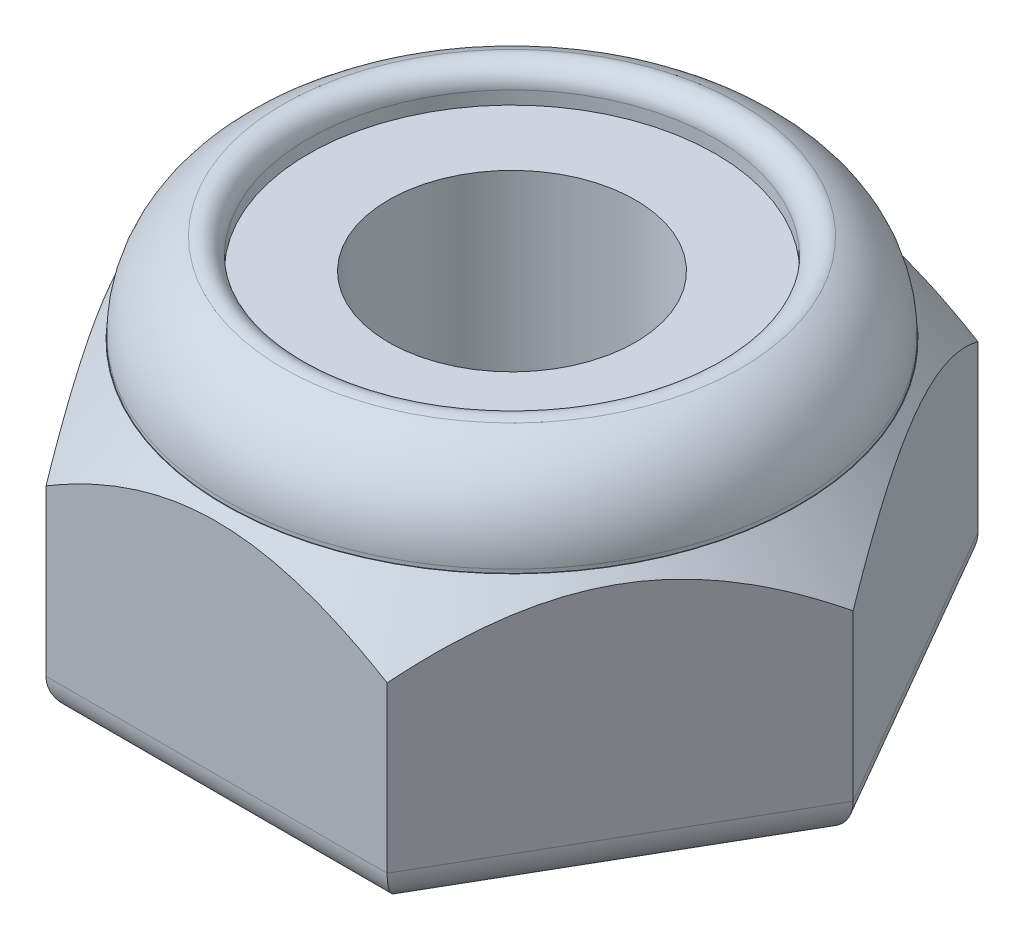
ISO-10303-21;
HEADER;
FILE_DESCRIPTION(('STEP AP214'),'2;1');
FILE_NAME('part.step','',(''),(''),'','','');
FILE_SCHEMA(('AUTOMOTIVE_DESIGN { 1 0 10303 214 1 1 1 1 }'));
ENDSEC;
DATA;
#1=APPLICATION_CONTEXT('core data for automotive mechanical design processes');
#2=APPLICATION_PROTOCOL_DEFINITION('international standard','automotive_design',2000,#1);
#3=PRODUCT_CONTEXT('',#1,'mechanical');
#4=PRODUCT('Part','Part','',(#3));
#5=PRODUCT_RELATED_PRODUCT_CATEGORY('part','',(#4));
#6=PRODUCT_DEFINITION_FORMATION('','',#4);
#7=PRODUCT_DEFINITION_CONTEXT('part definition',#1,'design');
#8=PRODUCT_DEFINITION('design','',#6,#7);
#9=PRODUCT_DEFINITION_SHAPE('','',#8);
#10=(LENGTH_UNIT() NAMED_UNIT(*) SI_UNIT(.MILLI.,.METRE.));
#11=(NAMED_UNIT(*) PLANE_ANGLE_UNIT() SI_UNIT($,.RADIAN.));
#12=(NAMED_UNIT(*) SI_UNIT($,.STERADIAN.) SOLID_ANGLE_UNIT());
#13=UNCERTAINTY_MEASURE_WITH_UNIT(LENGTH_MEASURE(1.E-05),#10,'distance_accuracy_value','');
#14=(GEOMETRIC_REPRESENTATION_CONTEXT(3) GLOBAL_UNCERTAINTY_ASSIGNED_CONTEXT((#13)) GLOBAL_UNIT_ASSIGNED_CONTEXT((#10,
#11,#12)) REPRESENTATION_CONTEXT('',''));
#15=CARTESIAN_POINT('',(0.,0.,0.));
#16=DIRECTION('',(0.,0.,1.));
#17=DIRECTION('',(1.,0.,0.));
#18=AXIS2_PLACEMENT_3D('',#15,#16,#17);
#19=CARTESIAN_POINT('',(0.,4.9784,0.));
#20=DIRECTION('',(0.,-1.,0.));
#21=DIRECTION('',(0.,0.,-1.));
#22=AXIS2_PLACEMENT_3D('',#19,#20,#21);
#23=CYLINDRICAL_SURFACE('',#22,3.937);
#24=CARTESIAN_POINT('',(0.,3.7084,0.));
#25=DIRECTION('',(0.,1.,0.));
#26=DIRECTION('',(0.,0.,1.));
#27=AXIS2_PLACEMENT_3D('',#24,#25,#26);
#28=CIRCLE('',#27,3.937);
#29=CARTESIAN_POINT('',(0.,3.7084,3.937));
#30=VERTEX_POINT('',#29);
#31=EDGE_CURVE('E249',#30,#30,#28,.T.);
#32=ORIENTED_EDGE('',*,*,#31,.F.);
#33=EDGE_LOOP('',(#32));
#34=FACE_BOUND('',#33,.T.);
#35=CARTESIAN_POINT('',(0.,3.6576,0.));
#36=DIRECTION('',(0.,-1.,0.));
#37=DIRECTION('',(0.,0.,-1.));
#38=AXIS2_PLACEMENT_3D('',#35,#36,#37);
#39=CIRCLE('',#38,3.937);
#40=CARTESIAN_POINT('',(0.,3.6576,-3.937));
#41=VERTEX_POINT('',#40);
#42=EDGE_CURVE('E19',#41,#41,#39,.F.);
#43=ORIENTED_EDGE('',*,*,#42,.T.);
#44=EDGE_LOOP('',(#43));
#45=FACE_BOUND('',#44,.T.);
#46=ADVANCED_FACE('F16',(#34,#45),#23,.T.);
#47=CARTESIAN_POINT('',(0.,3.7084,0.));
#48=DIRECTION('',(0.,1.,0.));
#49=DIRECTION('',(0.,0.,1.));
#50=AXIS2_PLACEMENT_3D('',#47,#48,#49);
#51=TOROIDAL_SURFACE('',#50,2.667,1.27);
#52=ORIENTED_EDGE('',*,*,#31,.T.);
#53=EDGE_LOOP('',(#52));
#54=FACE_BOUND('',#53,.T.);
#55=CARTESIAN_POINT('',(0.,4.88572150982644,0.));
#56=DIRECTION('',(0.,-1.,0.));
#57=DIRECTION('',(0.,0.,-1.));
#58=AXIS2_PLACEMENT_3D('',#55,#56,#57);
#59=CIRCLE('',#58,3.14325);
#60=CARTESIAN_POINT('',(0.,4.88572150982644,-3.14325));
#61=VERTEX_POINT('',#60);
#62=EDGE_CURVE('E243',#61,#61,#59,.F.);
#63=ORIENTED_EDGE('',*,*,#62,.F.);
#64=EDGE_LOOP('',(#63));
#65=FACE_BOUND('',#64,.T.);
#66=ADVANCED_FACE('F134',(#54,#65),#51,.T.);
#67=CARTESIAN_POINT('',(2.34315,3.6576,4.05845484975502));
#68=DIRECTION('',(0.,-1.,0.));
#69=DIRECTION('',(0.,0.,-1.));
#70=AXIS2_PLACEMENT_3D('',#67,#68,#69);
#71=PLANE('',#70);
#72=ORIENTED_EDGE('',*,*,#42,.F.);
#73=EDGE_LOOP('',(#72));
#74=FACE_BOUND('',#73,.T.);
#75=CARTESIAN_POINT('',(0.,3.65760000011051,0.));
#76=DIRECTION('',(0.,-1.,0.));
#77=DIRECTION('',(0.,0.,-1.));
#78=AXIS2_PLACEMENT_3D('',#75,#76,#77);
#79=CIRCLE('',#78,3.94407100938664);
#80=CARTESIAN_POINT('',(0.,3.65760000011051,-3.94407100938664));
#81=VERTEX_POINT('',#80);
#82=EDGE_CURVE('E119',#81,#81,#79,.T.);
#83=ORIENTED_EDGE('',*,*,#82,.F.);
#84=EDGE_LOOP('',(#83));
#85=FACE_BOUND('',#84,.T.);
#86=ADVANCED_FACE('F129',(#74,#85),#71,.F.);
#87=CARTESIAN_POINT('',(0.,4.65025720786115,0.));
#88=DIRECTION('',(0.,-1.,0.));
#89=DIRECTION('',(0.,0.,-1.));
#90=AXIS2_PLACEMENT_3D('',#87,#88,#89);
#91=TOROIDAL_SURFACE('',#90,3.048,0.254);
#92=CARTESIAN_POINT('',(0.,4.65025720786115,0.));
#93=DIRECTION('',(0.,1.,0.));
#94=DIRECTION('',(0.,0.,1.));
#95=AXIS2_PLACEMENT_3D('',#92,#93,#94);
#96=CIRCLE('',#95,2.794);
#97=CARTESIAN_POINT('',(0.,4.65025720786115,2.794));
#98=VERTEX_POINT('',#97);
#99=EDGE_CURVE('E104',#98,#98,#96,.F.);
#100=ORIENTED_EDGE('',*,*,#99,.T.);
#101=EDGE_LOOP('',(#100));
#102=FACE_BOUND('',#101,.T.);
#103=ORIENTED_EDGE('',*,*,#62,.T.);
#104=EDGE_LOOP('',(#103));
#105=FACE_BOUND('',#104,.T.);
#106=ADVANCED_FACE('F125',(#102,#105),#91,.T.);
#107=CARTESIAN_POINT('',(0.,2.76773860969115,0.));
#108=DIRECTION('',(0.,-1.,0.));
#109=DIRECTION('',(0.,0.,-1.));
#110=AXIS2_PLACEMENT_3D('',#107,#108,#109);
#111=CONICAL_SURFACE('',#110,4.69075337389313,0.698131700802158);
#112=CARTESIAN_POINT('',(-4.68630000001476,2.77304593398821,-5.3333815551093E-11));
#113=CARTESIAN_POINT('',(-4.65177717141793,2.81418235889091,0.0597952931149053));
#114=CARTESIAN_POINT('',(-4.61695780288956,2.85432113110728,0.120104208500933));
#115=CARTESIAN_POINT('',(-4.54666264441453,2.93230661020916,0.241858994511412));
#116=CARTESIAN_POINT('',(-4.51118655194523,2.97015222462005,0.303305389120424));
#117=CARTESIAN_POINT('',(-4.40329561885259,3.08018701500149,0.490177966909938));
#118=CARTESIAN_POINT('',(-4.32983334004397,3.14837015576205,0.617418366247689));
#119=CARTESIAN_POINT('',(-4.1797796499728,3.27092778609509,0.877318981315214));
#120=CARTESIAN_POINT('',(-4.10317943932402,3.32525984886677,1.00999443802899));
#121=CARTESIAN_POINT('',(-3.94747591651278,3.41577217646147,1.27968085045525));
#122=CARTESIAN_POINT('',(-3.86837998243724,3.45200143013375,1.4166790269463));
#123=CARTESIAN_POINT('',(-3.73746585196202,3.49372811243502,1.64342895235813));
#124=CARTESIAN_POINT('',(-3.68614686019516,3.50560413715319,1.73231605349153));
#125=CARTESIAN_POINT('',(-3.58316406708587,3.52008140702852,1.91068748346216));
#126=CARTESIAN_POINT('',(-3.53150020834088,3.5226810675312,2.00017191172355));
#127=CARTESIAN_POINT('',(-3.42855034551142,3.51847006524789,2.17848630477643));
#128=CARTESIAN_POINT('',(-3.3772638088531,3.51171021118305,2.26731719201287));
#129=CARTESIAN_POINT('',(-3.27519197708947,3.48921023555424,2.4441107906491));
#130=CARTESIAN_POINT('',(-3.22440670715057,3.4734696654174,2.53207345845939));
#131=CARTESIAN_POINT('',(-3.10963060134479,3.42817062222156,2.73087150520989));
#132=CARTESIAN_POINT('',(-3.04589899577138,3.39598542076133,2.84125788411098));
#133=CARTESIAN_POINT('',(-2.92018166739655,3.32004827846255,3.05900668424801));
#134=CARTESIAN_POINT('',(-2.85819691962206,3.27629001415058,3.16636741668776));
#135=CARTESIAN_POINT('',(-2.735889068299,3.17910361386979,3.37821082934389));
#136=CARTESIAN_POINT('',(-2.67557364738244,3.12563730731956,3.48268020285126));
#137=CARTESIAN_POINT('',(-2.55683004320588,3.01104764609313,3.68835015835892));
#138=CARTESIAN_POINT('',(-2.49840123089761,2.94992687749399,3.78955182990274));
#139=CARTESIAN_POINT('',(-2.42439626092569,2.86741854625153,3.91773219790672));
#140=CARTESIAN_POINT('',(-2.40802320106583,2.84883596648691,3.94609116945937));
#141=CARTESIAN_POINT('',(-2.3754621576302,2.81125673907332,4.00248855103733));
#142=CARTESIAN_POINT('',(-2.35927376441604,2.79226151161516,4.03052767057717));
#143=CARTESIAN_POINT('',(-2.3431499999717,2.77304593399368,4.05845484980404));
#144=B_SPLINE_CURVE_WITH_KNOTS('',3,(#112,#113,#114,#115,#116,#117,#118,#119,#120,#121,#122,
#123,#124,#125,#126,#127,#128,#129,#130,#131,#132,#133,#134,#135,#136,#137,#138,#139,#140,#141,
#142,#143),.UNSPECIFIED.,.F.,.F.,(4,2,2,2,2,2,2,2,2,2,2,2,2,2,2,4),(0.,0.241096809088565,
0.48230758945251,0.967637153847365,1.45443592242802,1.93991010956963,2.24950193433618,
2.5591466432483,2.86711700071403,3.17510274216898,3.56882084711336,3.96275452403261,
4.35827201930639,4.75365624679115,4.86660838982693,4.97921936905084),.UNSPECIFIED.);
#145=CARTESIAN_POINT('',(-4.68630000002839,2.77304593399358,0.));
#146=VERTEX_POINT('',#145);
#147=CARTESIAN_POINT('',(-2.34315000001419,2.77304593399358,4.05845484977959));
#148=VERTEX_POINT('',#147);
#149=EDGE_CURVE('E91',#146,#148,#144,.T.);
#150=ORIENTED_EDGE('',*,*,#149,.T.);
#151=CARTESIAN_POINT('',(-2.34315000005357,2.77304593398822,4.05845484974113));
#152=CARTESIAN_POINT('',(-2.27415972170409,2.81414935271336,4.05845484974989));
#153=CARTESIAN_POINT('',(-2.20457738522044,2.85425669884705,4.05845484975361));
#154=CARTESIAN_POINT('',(-2.06410193528096,2.93218331968193,4.05845484975642));
#155=CARTESIAN_POINT('',(-1.99320821641151,2.9700015013142,4.05845484975551));
#156=CARTESIAN_POINT('',(-1.77754688772429,3.07999086386455,4.05845484975401));
#157=CARTESIAN_POINT('',(-1.63068545869954,3.1481589403704,4.05845484975469));
#158=CARTESIAN_POINT('',(-1.33052752457963,3.27077676919262,4.05845484975534));
#159=CARTESIAN_POINT('',(-1.17720631609342,3.32516696804196,4.0584548497553));
#160=CARTESIAN_POINT('',(-0.865613503807779,3.41574608766059,4.05845484975473));
#161=CARTESIAN_POINT('',(-0.707359229311903,3.45199244874899,4.0584548497542));
#162=CARTESIAN_POINT('',(-0.456822143345071,3.49192146546895,4.05845484975548));
#163=CARTESIAN_POINT('',(-0.365672921156202,3.50290887295604,4.05845484975637));
#164=CARTESIAN_POINT('',(-0.183016322004482,3.51758027913678,4.05845484975366));
#165=CARTESIAN_POINT('',(-0.0915105175250817,3.52128341037061,4.05845484975007));
#166=CARTESIAN_POINT('',(0.104649468641441,3.52128177491765,4.0584548497495));
#167=CARTESIAN_POINT('',(0.209305100872023,3.51643705333648,4.05845484975354));
#168=CARTESIAN_POINT('',(0.417787181909869,3.49730239560235,4.05845484975649));
#169=CARTESIAN_POINT('',(0.521613181352877,3.48300765111694,4.05845484975541));
#170=CARTESIAN_POINT('',(0.728332544913562,3.44553375886282,4.05845484975462));
#171=CARTESIAN_POINT('',(0.831215331558566,3.42229697724238,4.05845484975491));
#172=CARTESIAN_POINT('',(1.03487580391125,3.36791830054733,4.05845484975512));
#173=CARTESIAN_POINT('',(1.13565289468809,3.33677420321768,4.05845484975504));
#174=CARTESIAN_POINT('',(1.33273383822163,3.26838741918099,4.05845484975499));
#175=CARTESIAN_POINT('',(1.42908716226035,3.23128582684656,4.05845484975501));
#176=CARTESIAN_POINT('',(1.61947291708309,3.15151071591982,4.05845484975502));
#177=CARTESIAN_POINT('',(1.71350470709807,3.10883567899407,4.05845484975502));
#178=CARTESIAN_POINT('',(1.89803195382395,3.01941532331662,4.05845484975501));
#179=CARTESIAN_POINT('',(1.98855798046432,2.97273255726059,4.05845484975502));
#180=CARTESIAN_POINT('',(2.16742834958163,2.87556944084479,4.05845484975502));
#181=CARTESIAN_POINT('',(2.25577492892455,2.82509321932285,4.05845484975502));
#182=CARTESIAN_POINT('',(2.34315000005566,2.77304593399424,4.05845484975502));
#183=B_SPLINE_CURVE_WITH_KNOTS('',3,(#151,#152,#153,#154,#155,#156,#157,#158,#159,#160,#161,
#162,#163,#164,#165,#166,#167,#168,#169,#170,#171,#172,#173,#174,#175,#176,#177,#178,#179,#180,
#181,#182),.UNSPECIFIED.,.F.,.F.,(4,2,2,2,2,2,2,2,2,2,2,2,2,2,2,4),(0.,0.24090330355952,
0.481920744736242,0.967059466968448,1.4542606837498,1.93990959177135,2.21507934695766,
2.4895253838939,2.80337599596431,3.11738642360394,3.43345557972405,3.74961286055439,
4.0591611810716,4.36879400620232,4.67425708545867,4.97939238068026),.UNSPECIFIED.);
#184=CARTESIAN_POINT('',(2.34315000001419,2.77304593399358,4.05845484977959));
#185=VERTEX_POINT('',#184);
#186=EDGE_CURVE('E83',#148,#185,#183,.T.);
#187=ORIENTED_EDGE('',*,*,#186,.T.);
#188=CARTESIAN_POINT('',(2.3431499999612,2.77304593398822,4.05845484979446));
#189=CARTESIAN_POINT('',(2.37767282857321,2.81418235889091,3.99865955663499));
#190=CARTESIAN_POINT('',(2.41249219710801,2.85432113110729,3.93835064125267));
#191=CARTESIAN_POINT('',(2.48278735558791,2.93230661020917,3.816595855245));
#192=CARTESIAN_POINT('',(2.51826344805563,2.97015222462005,3.75514946063508));
#193=CARTESIAN_POINT('',(2.62615438114571,3.08018701500149,3.56827688284408));
#194=CARTESIAN_POINT('',(2.69961665995557,3.14837015576206,3.44103648350706));
#195=CARTESIAN_POINT('',(2.84967035002766,3.2709277860951,3.18113586844006));
#196=CARTESIAN_POINT('',(2.9262705606761,3.32525984886677,3.04846041172609));
#197=CARTESIAN_POINT('',(3.08197408348711,3.41577217646148,2.77877399929969));
#198=CARTESIAN_POINT('',(3.16107001756274,3.45200143013376,2.64177582280869));
#199=CARTESIAN_POINT('',(3.291984148038,3.49372811243503,2.41502589739689));
#200=CARTESIAN_POINT('',(3.34330313980485,3.50560413715319,2.32613879626348));
#201=CARTESIAN_POINT('',(3.44628593291413,3.52008140702853,2.14776736629285));
#202=CARTESIAN_POINT('',(3.49794979165912,3.52268106753121,2.05828293803146));
#203=CARTESIAN_POINT('',(3.60089965448859,3.51847006524789,1.87996854497858));
#204=CARTESIAN_POINT('',(3.6521861911469,3.51171021118306,1.79113765774214));
#205=CARTESIAN_POINT('',(3.75425802291053,3.48921023555425,1.61434405910591));
#206=CARTESIAN_POINT('',(3.80504329284943,3.47346966541741,1.52638139129562));
#207=CARTESIAN_POINT('',(3.91981939865521,3.42817062222156,1.32758334454512));
#208=CARTESIAN_POINT('',(3.98355100422862,3.39598542076133,1.21719696564403));
#209=CARTESIAN_POINT('',(4.10926833260345,3.32004827846255,0.999448165506999));
#210=CARTESIAN_POINT('',(4.17125308037794,3.27629001415058,0.892087433067251));
#211=CARTESIAN_POINT('',(4.293560931701,3.17910361386979,0.680244020411125));
#212=CARTESIAN_POINT('',(4.35387635261756,3.12563730731956,0.575774646903749));
#213=CARTESIAN_POINT('',(4.47261995679412,3.01104764609313,0.370104691396086));
#214=CARTESIAN_POINT('',(4.53104876910239,2.94992687749399,0.268903019852268));
#215=CARTESIAN_POINT('',(4.60505373907431,2.86741854625153,0.140722651848287));
#216=CARTESIAN_POINT('',(4.62142679893417,2.84883596648691,0.112363680295636));
#217=CARTESIAN_POINT('',(4.6539878423698,2.81125673907332,0.055966298717677));
#218=CARTESIAN_POINT('',(4.67017623558396,2.79226151161516,0.0279271791778412));
#219=CARTESIAN_POINT('',(4.6863000000283,2.77304593399368,-4.90273860582746E-11));
#220=B_SPLINE_CURVE_WITH_KNOTS('',3,(#188,#189,#190,#191,#192,#193,#194,#195,#196,#197,#198,
#199,#200,#201,#202,#203,#204,#205,#206,#207,#208,#209,#210,#211,#212,#213,#214,#215,#216,#217,
#218,#219),.UNSPECIFIED.,.F.,.F.,(4,2,2,2,2,2,2,2,2,2,2,2,2,2,2,4),(0.,0.241096809088565,
0.48230758945251,0.967637153847363,1.45443592242802,1.93991010956962,2.24950193433617,
2.5591466432483,2.86711700071402,3.17510274216897,3.56882084711335,3.9627545240326,
4.35827201930639,4.75365624679114,4.86660838982692,4.97921936905084),.UNSPECIFIED.);
#221=CARTESIAN_POINT('',(4.68630000001419,2.7730459340105,-2.45821360759307E-11));
#222=VERTEX_POINT('',#221);
#223=EDGE_CURVE('E88',#185,#222,#220,.T.);
#224=ORIENTED_EDGE('',*,*,#223,.T.);
#225=CARTESIAN_POINT('',(4.68630000001476,2.77304593398822,5.33267015141622E-11));
#226=CARTESIAN_POINT('',(4.65177717141792,2.81418235889091,-0.0597952931149122));
#227=CARTESIAN_POINT('',(4.61695780288956,2.85432113110729,-0.12010420850094));
#228=CARTESIAN_POINT('',(4.54666264441452,2.93230661020917,-0.241858994511418));
#229=CARTESIAN_POINT('',(4.51118655194522,2.97015222462005,-0.303305389120429));
#230=CARTESIAN_POINT('',(4.40329561885258,3.0801870150015,-0.490177966909942));
#231=CARTESIAN_POINT('',(4.32983334004397,3.14837015576206,-0.617418366247694));
#232=CARTESIAN_POINT('',(4.1797796499728,3.27092778609509,-0.877318981315217));
#233=CARTESIAN_POINT('',(4.10317943932402,3.32525984886677,-1.00999443802899));
#234=CARTESIAN_POINT('',(3.94747591651277,3.41577217646148,-1.27968085045525));
#235=CARTESIAN_POINT('',(3.86837998243724,3.45200143013375,-1.4166790269463));
#236=CARTESIAN_POINT('',(3.73746585196202,3.49372811243502,-1.64342895235813));
#237=CARTESIAN_POINT('',(3.68614686019516,3.50560413715319,-1.73231605349153));
#238=CARTESIAN_POINT('',(3.58316406708587,3.52008140702852,-1.91068748346216));
#239=CARTESIAN_POINT('',(3.53150020834088,3.5226810675312,-2.00017191172355));
#240=CARTESIAN_POINT('',(3.42855034551142,3.51847006524789,-2.17848630477643));
#241=CARTESIAN_POINT('',(3.3772638088531,3.51171021118306,-2.26731719201287));
#242=CARTESIAN_POINT('',(3.27519197708948,3.48921023555424,-2.4441107906491));
#243=CARTESIAN_POINT('',(3.22440670715057,3.4734696654174,-2.53207345845939));
#244=CARTESIAN_POINT('',(3.10963060134479,3.42817062222156,-2.73087150520989));
#245=CARTESIAN_POINT('',(3.04589899577138,3.39598542076133,-2.84125788411098));
#246=CARTESIAN_POINT('',(2.92018166739655,3.32004827846255,-3.05900668424801));
#247=CARTESIAN_POINT('',(2.85819691962206,3.27629001415058,-3.16636741668776));
#248=CARTESIAN_POINT('',(2.735889068299,3.17910361386979,-3.37821082934388));
#249=CARTESIAN_POINT('',(2.67557364738245,3.12563730731956,-3.48268020285126));
#250=CARTESIAN_POINT('',(2.55683004320588,3.01104764609313,-3.68835015835892));
#251=CARTESIAN_POINT('',(2.49840123089762,2.94992687749399,-3.78955182990274));
#252=CARTESIAN_POINT('',(2.42439626092569,2.86741854625153,-3.91773219790672));
#253=CARTESIAN_POINT('',(2.40802320106583,2.84883596648691,-3.94609116945937));
#254=CARTESIAN_POINT('',(2.3754621576302,2.81125673907332,-4.00248855103733));
#255=CARTESIAN_POINT('',(2.35927376441604,2.79226151161516,-4.03052767057717));
#256=CARTESIAN_POINT('',(2.3431499999717,2.77304593399368,-4.05845484980404));
#257=B_SPLINE_CURVE_WITH_KNOTS('',3,(#225,#226,#227,#228,#229,#230,#231,#232,#233,#234,#235,
#236,#237,#238,#239,#240,#241,#242,#243,#244,#245,#246,#247,#248,#249,#250,#251,#252,#253,#254,
#255,#256),.UNSPECIFIED.,.F.,.F.,(4,2,2,2,2,2,2,2,2,2,2,2,2,2,2,4),(0.,0.241096809088564,
0.482307589452508,0.96763715384736,1.45443592242801,1.93991010956962,2.24950193433616,
2.55914664324829,2.86711700071401,3.17510274216896,3.56882084711335,3.96275452403259,
4.35827201930638,4.75365624679113,4.86660838982692,4.97921936905084),.UNSPECIFIED.);
#258=CARTESIAN_POINT('',(2.34315000001419,2.77304593399358,-4.0584548497796));
#259=VERTEX_POINT('',#258);
#260=EDGE_CURVE('E193',#222,#259,#257,.T.);
#261=ORIENTED_EDGE('',*,*,#260,.T.);
#262=CARTESIAN_POINT('',(2.34315000005357,2.77304593398821,-4.05845484974114));
#263=CARTESIAN_POINT('',(2.27415972170409,2.81414935271335,-4.05845484974989));
#264=CARTESIAN_POINT('',(2.20457738522045,2.85425669884704,-4.05845484975361));
#265=CARTESIAN_POINT('',(2.06410193528096,2.93218331968193,-4.05845484975643));
#266=CARTESIAN_POINT('',(1.99320821641151,2.97000150131419,-4.05845484975552));
#267=CARTESIAN_POINT('',(1.77754688772429,3.07999086386454,-4.05845484975402));
#268=CARTESIAN_POINT('',(1.63068545869954,3.1481589403704,-4.0584548497547));
#269=CARTESIAN_POINT('',(1.33052752457963,3.27077676919261,-4.05845484975534));
#270=CARTESIAN_POINT('',(1.17720631609342,3.32516696804195,-4.0584548497553));
#271=CARTESIAN_POINT('',(0.865613503807778,3.41574608766058,-4.05845484975474));
#272=CARTESIAN_POINT('',(0.707359229311901,3.45199244874898,-4.0584548497542));
#273=CARTESIAN_POINT('',(0.456822143345069,3.49192146546895,-4.05845484975548));
#274=CARTESIAN_POINT('',(0.365672921156201,3.50290887295604,-4.05845484975637));
#275=CARTESIAN_POINT('',(0.183016322004481,3.51758027913677,-4.05845484975367));
#276=CARTESIAN_POINT('',(0.0915105175250814,3.5212834103706,-4.05845484975008));
#277=CARTESIAN_POINT('',(-0.104649468641441,3.52128177491764,-4.0584548497495));
#278=CARTESIAN_POINT('',(-0.209305100872023,3.51643705333648,-4.05845484975354));
#279=CARTESIAN_POINT('',(-0.41778718190987,3.49730239560234,-4.0584548497565));
#280=CARTESIAN_POINT('',(-0.521613181352877,3.48300765111693,-4.05845484975542));
#281=CARTESIAN_POINT('',(-0.728332544913562,3.44553375886281,-4.05845484975462));
#282=CARTESIAN_POINT('',(-0.831215331558566,3.42229697724237,-4.05845484975491));
#283=CARTESIAN_POINT('',(-1.03487580391125,3.36791830054732,-4.05845484975513));
#284=CARTESIAN_POINT('',(-1.13565289468809,3.33677420321767,-4.05845484975505));
#285=CARTESIAN_POINT('',(-1.33273383822163,3.26838741918098,-4.05845484975499));
#286=CARTESIAN_POINT('',(-1.42908716226035,3.23128582684655,-4.05845484975501));
#287=CARTESIAN_POINT('',(-1.61947291708309,3.15151071591982,-4.05845484975503));
#288=CARTESIAN_POINT('',(-1.71350470709807,3.10883567899406,-4.05845484975502));
#289=CARTESIAN_POINT('',(-1.89803195382395,3.01941532331662,-4.05845484975502));
#290=CARTESIAN_POINT('',(-1.98855798046431,2.97273255726059,-4.05845484975502));
#291=CARTESIAN_POINT('',(-2.16742834958162,2.87556944084479,-4.05845484975502));
#292=CARTESIAN_POINT('',(-2.25577492892455,2.82509321932284,-4.05845484975502));
#293=CARTESIAN_POINT('',(-2.34315000005566,2.77304593399424,-4.05845484975502));
#294=B_SPLINE_CURVE_WITH_KNOTS('',3,(#262,#263,#264,#265,#266,#267,#268,#269,#270,#271,#272,
#273,#274,#275,#276,#277,#278,#279,#280,#281,#282,#283,#284,#285,#286,#287,#288,#289,#290,#291,
#292,#293),.UNSPECIFIED.,.F.,.F.,(4,2,2,2,2,2,2,2,2,2,2,2,2,2,2,4),(0.,0.24090330355952,
0.481920744736243,0.96705946696845,1.4542606837498,1.93990959177135,2.21507934695766,
2.48952538389391,2.80337599596432,3.11738642360394,3.43345557972405,3.74961286055439,
4.0591611810716,4.36879400620232,4.67425708545866,4.97939238068026),.UNSPECIFIED.);
#295=CARTESIAN_POINT('',(-2.34315000001419,2.77304593399358,-4.0584548497796));
#296=VERTEX_POINT('',#295);
#297=EDGE_CURVE('E204',#259,#296,#294,.T.);
#298=ORIENTED_EDGE('',*,*,#297,.T.);
#299=CARTESIAN_POINT('',(-2.3431499999612,2.77304593398821,-4.05845484979447));
#300=CARTESIAN_POINT('',(-2.37767282857321,2.81418235889091,-3.99865955663499));
#301=CARTESIAN_POINT('',(-2.41249219710802,2.85432113110728,-3.93835064125268));
#302=CARTESIAN_POINT('',(-2.48278735558791,2.93230661020916,-3.81659585524501));
#303=CARTESIAN_POINT('',(-2.51826344805563,2.97015222462005,-3.75514946063508));
#304=CARTESIAN_POINT('',(-2.62615438114571,3.08018701500149,-3.56827688284409));
#305=CARTESIAN_POINT('',(-2.69961665995557,3.14837015576205,-3.44103648350706));
#306=CARTESIAN_POINT('',(-2.84967035002766,3.27092778609509,-3.18113586844007));
#307=CARTESIAN_POINT('',(-2.9262705606761,3.32525984886676,-3.0484604117261));
#308=CARTESIAN_POINT('',(-3.08197408348711,3.41577217646147,-2.7787739992997));
#309=CARTESIAN_POINT('',(-3.16107001756274,3.45200143013375,-2.6417758228087));
#310=CARTESIAN_POINT('',(-3.291984148038,3.49372811243502,-2.4150258973969));
#311=CARTESIAN_POINT('',(-3.34330313980485,3.50560413715318,-2.32613879626349));
#312=CARTESIAN_POINT('',(-3.44628593291413,3.52008140702852,-2.14776736629286));
#313=CARTESIAN_POINT('',(-3.49794979165912,3.5226810675312,-2.05828293803147));
#314=CARTESIAN_POINT('',(-3.60089965448859,3.51847006524788,-1.87996854497859));
#315=CARTESIAN_POINT('',(-3.6521861911469,3.51171021118305,-1.79113765774214));
#316=CARTESIAN_POINT('',(-3.75425802291053,3.48921023555424,-1.61434405910592));
#317=CARTESIAN_POINT('',(-3.80504329284944,3.4734696654174,-1.52638139129563));
#318=CARTESIAN_POINT('',(-3.91981939865521,3.42817062222155,-1.32758334454512));
#319=CARTESIAN_POINT('',(-3.98355100422863,3.39598542076132,-1.21719696564403));
#320=CARTESIAN_POINT('',(-4.10926833260346,3.32004827846254,-0.999448165507007));
#321=CARTESIAN_POINT('',(-4.17125308037794,3.27629001415057,-0.892087433067258));
#322=CARTESIAN_POINT('',(-4.29356093170101,3.17910361386978,-0.680244020411132));
#323=CARTESIAN_POINT('',(-4.35387635261756,3.12563730731955,-0.575774646903757));
#324=CARTESIAN_POINT('',(-4.47261995679413,3.01104764609312,-0.370104691396094));
#325=CARTESIAN_POINT('',(-4.53104876910239,2.94992687749399,-0.268903019852276));
#326=CARTESIAN_POINT('',(-4.60505373907432,2.86741854625152,-0.140722651848295));
#327=CARTESIAN_POINT('',(-4.62142679893418,2.84883596648691,-0.112363680295645));
#328=CARTESIAN_POINT('',(-4.6539878423698,2.81125673907331,-0.0559662987176857));
#329=CARTESIAN_POINT('',(-4.67017623558397,2.79226151161515,-0.0279271791778497));
#330=CARTESIAN_POINT('',(-4.68630000002831,2.77304593399367,4.90190782069009E-11));
#331=B_SPLINE_CURVE_WITH_KNOTS('',3,(#299,#300,#301,#302,#303,#304,#305,#306,#307,#308,#309,
#310,#311,#312,#313,#314,#315,#316,#317,#318,#319,#320,#321,#322,#323,#324,#325,#326,#327,#328,
#329,#330),.UNSPECIFIED.,.F.,.F.,(4,2,2,2,2,2,2,2,2,2,2,2,2,2,2,4),(0.,0.241096809088564,
0.482307589452509,0.967637153847362,1.45443592242802,1.93991010956962,2.24950193433617,
2.5591466432483,2.86711700071402,3.17510274216897,3.56882084711335,3.9627545240326,
4.35827201930639,4.75365624679114,4.86660838982692,4.97921936905084),.UNSPECIFIED.);
#332=EDGE_CURVE('E211',#296,#146,#331,.T.);
#333=ORIENTED_EDGE('',*,*,#332,.T.);
#334=EDGE_LOOP('',(#150,#187,#224,#261,#298,#333));
#335=FACE_BOUND('',#334,.T.);
#336=ORIENTED_EDGE('',*,*,#82,.T.);
#337=EDGE_LOOP('',(#336));
#338=FACE_BOUND('',#337,.T.);
#339=ADVANCED_FACE('F85',(#335,#338),#111,.T.);
#340=CARTESIAN_POINT('',(0.,4.4704,0.));
#341=DIRECTION('',(0.,1.,0.));
#342=DIRECTION('',(0.,0.,1.));
#343=AXIS2_PLACEMENT_3D('',#340,#341,#342);
#344=CYLINDRICAL_SURFACE('',#343,2.794);
#345=ORIENTED_EDGE('',*,*,#99,.F.);
#346=EDGE_LOOP('',(#345));
#347=FACE_BOUND('',#346,.T.);
#348=CARTESIAN_POINT('',(0.,4.4704,0.));
#349=DIRECTION('',(0.,1.,0.));
#350=DIRECTION('',(0.,0.,1.));
#351=AXIS2_PLACEMENT_3D('',#348,#349,#350);
#352=CIRCLE('',#351,2.794);
#353=CARTESIAN_POINT('',(0.,4.4704,2.794));
#354=VERTEX_POINT('',#353);
#355=EDGE_CURVE('E202',#354,#354,#352,.T.);
#356=ORIENTED_EDGE('',*,*,#355,.F.);
#357=EDGE_LOOP('',(#356));
#358=FACE_BOUND('',#357,.T.);
#359=ADVANCED_FACE('F414',(#347,#358),#344,.F.);
#360=CARTESIAN_POINT('',(2.34315,3.6576,4.05845484975502));
#361=DIRECTION('',(-0.866025403784439,0.,-0.499999999999999));
#362=DIRECTION('',(-0.499999999999999,0.,0.866025403784439));
#363=AXIS2_PLACEMENT_3D('',#360,#361,#362);
#364=PLANE('',#363);
#365=DIRECTION('',(-0.499999999999999,0.,0.866025403784439));
#366=VECTOR('',#365,1.);
#367=CARTESIAN_POINT('',(2.34315,0.508,4.05845484975502));
#368=LINE('',#367,#366);
#369=CARTESIAN_POINT('',(4.6863,0.508,0.));
#370=VERTEX_POINT('',#369);
#371=CARTESIAN_POINT('',(2.34315000000001,0.508,4.05845484975502));
#372=VERTEX_POINT('',#371);
#373=EDGE_CURVE('E273',#370,#372,#368,.T.);
#374=ORIENTED_EDGE('',*,*,#373,.F.);
#375=DIRECTION('',(0.,1.,0.));
#376=VECTOR('',#375,1.);
#377=CARTESIAN_POINT('',(4.6863,3.6576,0.));
#378=LINE('',#377,#376);
#379=EDGE_CURVE('E102',#370,#222,#378,.T.);
#380=ORIENTED_EDGE('',*,*,#379,.T.);
#381=ORIENTED_EDGE('',*,*,#223,.F.);
#382=DIRECTION('',(0.,1.,0.));
#383=VECTOR('',#382,1.);
#384=CARTESIAN_POINT('',(2.34315000000001,3.6576,4.05845484975502));
#385=LINE('',#384,#383);
#386=EDGE_CURVE('E95',#185,#372,#385,.F.);
#387=ORIENTED_EDGE('',*,*,#386,.T.);
#388=EDGE_LOOP('',(#374,#380,#381,#387));
#389=FACE_BOUND('',#388,.T.);
#390=ADVANCED_FACE('F99',(#389),#364,.F.);
#391=CARTESIAN_POINT('',(-2.34315,3.6576,4.05845484975501));
#392=DIRECTION('',(0.,0.,-1.));
#393=DIRECTION('',(-1.,0.,0.));
#394=AXIS2_PLACEMENT_3D('',#391,#392,#393);
#395=PLANE('',#394);
#396=DIRECTION('',(-1.,0.,0.));
#397=VECTOR('',#396,1.);
#398=CARTESIAN_POINT('',(-2.34315,0.508,4.05845484975501));
#399=LINE('',#398,#397);
#400=CARTESIAN_POINT('',(-2.34315,0.508,4.05845484975501));
#401=VERTEX_POINT('',#400);
#402=EDGE_CURVE('E109',#372,#401,#399,.T.);
#403=ORIENTED_EDGE('',*,*,#402,.F.);
#404=ORIENTED_EDGE('',*,*,#386,.F.);
#405=ORIENTED_EDGE('',*,*,#186,.F.);
#406=DIRECTION('',(0.,1.,0.));
#407=VECTOR('',#406,1.);
#408=CARTESIAN_POINT('',(-2.34315,3.6576,4.05845484975501));
#409=LINE('',#408,#407);
#410=EDGE_CURVE('E112',#148,#401,#409,.F.);
#411=ORIENTED_EDGE('',*,*,#410,.T.);
#412=EDGE_LOOP('',(#403,#404,#405,#411));
#413=FACE_BOUND('',#412,.T.);
#414=ADVANCED_FACE('F107',(#413),#395,.F.);
#415=CARTESIAN_POINT('',(-4.6863,3.6576,0.));
#416=DIRECTION('',(0.866025403784439,0.,-0.5));
#417=DIRECTION('',(-0.5,0.,-0.866025403784439));
#418=AXIS2_PLACEMENT_3D('',#415,#416,#417);
#419=PLANE('',#418);
#420=DIRECTION('',(-0.5,0.,-0.866025403784439));
#421=VECTOR('',#420,1.);
#422=CARTESIAN_POINT('',(-4.6863,0.508,0.));
#423=LINE('',#422,#421);
#424=CARTESIAN_POINT('',(-4.6863,0.508,0.));
#425=VERTEX_POINT('',#424);
#426=EDGE_CURVE('E269',#401,#425,#423,.T.);
#427=ORIENTED_EDGE('',*,*,#426,.F.);
#428=ORIENTED_EDGE('',*,*,#410,.F.);
#429=ORIENTED_EDGE('',*,*,#149,.F.);
#430=DIRECTION('',(0.,1.,0.));
#431=VECTOR('',#430,1.);
#432=CARTESIAN_POINT('',(-4.6863,3.6576,0.));
#433=LINE('',#432,#431);
#434=EDGE_CURVE('E210',#146,#425,#433,.F.);
#435=ORIENTED_EDGE('',*,*,#434,.T.);
#436=EDGE_LOOP('',(#427,#428,#429,#435));
#437=FACE_BOUND('',#436,.T.);
#438=ADVANCED_FACE('F224',(#437),#419,.F.);
#439=CARTESIAN_POINT('',(-2.34315,3.6576,-4.05845484975502));
#440=DIRECTION('',(0.866025403784438,0.,0.5));
#441=DIRECTION('',(0.5,0.,-0.866025403784438));
#442=AXIS2_PLACEMENT_3D('',#439,#440,#441);
#443=PLANE('',#442);
#444=DIRECTION('',(0.5,0.,-0.866025403784438));
#445=VECTOR('',#444,1.);
#446=CARTESIAN_POINT('',(-2.34315,0.508,-4.05845484975502));
#447=LINE('',#446,#445);
#448=CARTESIAN_POINT('',(-2.34315,0.508,-4.05845484975502));
#449=VERTEX_POINT('',#448);
#450=EDGE_CURVE('E265',#425,#449,#447,.T.);
#451=ORIENTED_EDGE('',*,*,#450,.F.);
#452=ORIENTED_EDGE('',*,*,#434,.F.);
#453=ORIENTED_EDGE('',*,*,#332,.F.);
#454=DIRECTION('',(0.,1.,0.));
#455=VECTOR('',#454,1.);
#456=CARTESIAN_POINT('',(-2.34315,3.6576,-4.05845484975502));
#457=LINE('',#456,#455);
#458=EDGE_CURVE('E201',#296,#449,#457,.F.);
#459=ORIENTED_EDGE('',*,*,#458,.T.);
#460=EDGE_LOOP('',(#451,#452,#453,#459));
#461=FACE_BOUND('',#460,.T.);
#462=ADVANCED_FACE('F221',(#461),#443,.F.);
#463=CARTESIAN_POINT('',(2.34315,3.6576,-4.05845484975502));
#464=DIRECTION('',(0.,0.,1.));
#465=DIRECTION('',(1.,0.,0.));
#466=AXIS2_PLACEMENT_3D('',#463,#464,#465);
#467=PLANE('',#466);
#468=DIRECTION('',(1.,0.,0.));
#469=VECTOR('',#468,1.);
#470=CARTESIAN_POINT('',(2.34315,0.508,-4.05845484975502));
#471=LINE('',#470,#469);
#472=CARTESIAN_POINT('',(2.34315,0.508,-4.05845484975502));
#473=VERTEX_POINT('',#472);
#474=EDGE_CURVE('E261',#449,#473,#471,.T.);
#475=ORIENTED_EDGE('',*,*,#474,.F.);
#476=ORIENTED_EDGE('',*,*,#458,.F.);
#477=ORIENTED_EDGE('',*,*,#297,.F.);
#478=DIRECTION('',(0.,1.,0.));
#479=VECTOR('',#478,1.);
#480=CARTESIAN_POINT('',(2.34315,3.6576,-4.05845484975501));
#481=LINE('',#480,#479);
#482=EDGE_CURVE('E200',#259,#473,#481,.F.);
#483=ORIENTED_EDGE('',*,*,#482,.T.);
#484=EDGE_LOOP('',(#475,#476,#477,#483));
#485=FACE_BOUND('',#484,.T.);
#486=ADVANCED_FACE('F188',(#485),#467,.F.);
#487=CARTESIAN_POINT('',(4.6863,3.6576,0.));
#488=DIRECTION('',(-0.866025403784439,0.,0.5));
#489=DIRECTION('',(0.5,0.,0.866025403784439));
#490=AXIS2_PLACEMENT_3D('',#487,#488,#489);
#491=PLANE('',#490);
#492=DIRECTION('',(0.5,0.,0.866025403784439));
#493=VECTOR('',#492,1.);
#494=CARTESIAN_POINT('',(4.6863,0.508,0.));
#495=LINE('',#494,#493);
#496=EDGE_CURVE('E259',#473,#370,#495,.T.);
#497=ORIENTED_EDGE('',*,*,#496,.F.);
#498=ORIENTED_EDGE('',*,*,#482,.F.);
#499=ORIENTED_EDGE('',*,*,#260,.F.);
#500=ORIENTED_EDGE('',*,*,#379,.F.);
#501=EDGE_LOOP('',(#497,#498,#499,#500));
#502=FACE_BOUND('',#501,.T.);
#503=ADVANCED_FACE('F183',(#502),#491,.F.);
#504=CARTESIAN_POINT('',(0.,4.4704,0.));
#505=DIRECTION('',(0.,1.,0.));
#506=DIRECTION('',(0.,0.,1.));
#507=AXIS2_PLACEMENT_3D('',#504,#505,#506);
#508=PLANE('',#507);
#509=CARTESIAN_POINT('',(0.,4.4704,0.));
#510=DIRECTION('',(0.,1.,0.));
#511=DIRECTION('',(0.,0.,1.));
#512=AXIS2_PLACEMENT_3D('',#509,#510,#511);
#513=CIRCLE('',#512,1.69545);
#514=CARTESIAN_POINT('',(0.,4.4704,1.69545));
#515=VERTEX_POINT('',#514);
#516=EDGE_CURVE('E252',#515,#515,#513,.F.);
#517=ORIENTED_EDGE('',*,*,#516,.T.);
#518=EDGE_LOOP('',(#517));
#519=FACE_BOUND('',#518,.T.);
#520=ORIENTED_EDGE('',*,*,#355,.T.);
#521=EDGE_LOOP('',(#520));
#522=FACE_BOUND('',#521,.T.);
#523=ADVANCED_FACE('F179',(#519,#522),#508,.T.);
#524=CARTESIAN_POINT('',(1.9032090948775,0.508,3.80445484975502));
#525=DIRECTION('',(-0.499999999999999,0.,0.866025403784439));
#526=DIRECTION('',(0.866025403784439,0.,0.499999999999999));
#527=AXIS2_PLACEMENT_3D('',#524,#525,#526);
#528=CYLINDRICAL_SURFACE('',#527,0.508);
#529=CARTESIAN_POINT('',(2.04985606325167,0.508,3.55045484975502));
#530=DIRECTION('',(-0.866025403784439,0.,0.5));
#531=DIRECTION('',(-0.5,0.,-0.866025403784439));
#532=AXIS2_PLACEMENT_3D('',#529,#530,#531);
#533=ELLIPSE('',#532,0.58658787349666,0.508);
#534=CARTESIAN_POINT('',(2.04985606325167,0.,3.55045484975502));
#535=VERTEX_POINT('',#534);
#536=EDGE_CURVE('E272',#535,#372,#533,.T.);
#537=ORIENTED_EDGE('',*,*,#536,.F.);
#538=DIRECTION('',(-0.499999999999999,0.,0.866025403784439));
#539=VECTOR('',#538,1.);
#540=CARTESIAN_POINT('',(4.09971212650334,0.,0.));
#541=LINE('',#540,#539);
#542=CARTESIAN_POINT('',(4.09971212650334,0.,0.));
#543=VERTEX_POINT('',#542);
#544=EDGE_CURVE('E255',#543,#535,#541,.T.);
#545=ORIENTED_EDGE('',*,*,#544,.F.);
#546=CARTESIAN_POINT('',(4.09971212650334,0.508,0.));
#547=DIRECTION('',(0.,0.,1.));
#548=DIRECTION('',(1.,0.,0.));
#549=AXIS2_PLACEMENT_3D('',#546,#547,#548);
#550=ELLIPSE('',#549,0.58658787349666,0.508);
#551=EDGE_CURVE('E256',#370,#543,#550,.F.);
#552=ORIENTED_EDGE('',*,*,#551,.F.);
#553=ORIENTED_EDGE('',*,*,#373,.T.);
#554=EDGE_LOOP('',(#537,#545,#552,#553));
#555=FACE_BOUND('',#554,.T.);
#556=ADVANCED_FACE('F175',(#555),#528,.T.);
#557=CARTESIAN_POINT('',(-2.34315,0.508,3.55045484975501));
#558=DIRECTION('',(-1.,0.,0.));
#559=DIRECTION('',(0.,0.,1.));
#560=AXIS2_PLACEMENT_3D('',#557,#558,#559);
#561=CYLINDRICAL_SURFACE('',#560,0.508);
#562=ORIENTED_EDGE('',*,*,#536,.T.);
#563=ORIENTED_EDGE('',*,*,#402,.T.);
#564=CARTESIAN_POINT('',(-2.04985606325167,0.508,3.55045484975501));
#565=DIRECTION('',(-0.866025403784439,0.,-0.5));
#566=DIRECTION('',(0.5,0.,-0.866025403784439));
#567=AXIS2_PLACEMENT_3D('',#564,#565,#566);
#568=ELLIPSE('',#567,0.58658787349666,0.508);
#569=CARTESIAN_POINT('',(-2.04985606325167,0.,3.55045484975502));
#570=VERTEX_POINT('',#569);
#571=EDGE_CURVE('E270',#570,#401,#568,.T.);
#572=ORIENTED_EDGE('',*,*,#571,.F.);
#573=DIRECTION('',(1.,0.,0.));
#574=VECTOR('',#573,1.);
#575=CARTESIAN_POINT('',(2.34315,0.,3.55045484975502));
#576=LINE('',#575,#574);
#577=EDGE_CURVE('E304',#535,#570,#576,.F.);
#578=ORIENTED_EDGE('',*,*,#577,.F.);
#579=EDGE_LOOP('',(#562,#563,#572,#578));
#580=FACE_BOUND('',#579,.T.);
#581=ADVANCED_FACE('F171',(#580),#561,.T.);
#582=CARTESIAN_POINT('',(-4.24635909487751,0.508,-0.254000000000004));
#583=DIRECTION('',(-0.5,0.,-0.866025403784439));
#584=DIRECTION('',(-0.866025403784439,0.,0.5));
#585=AXIS2_PLACEMENT_3D('',#582,#583,#584);
#586=CYLINDRICAL_SURFACE('',#585,0.508);
#587=ORIENTED_EDGE('',*,*,#571,.T.);
#588=ORIENTED_EDGE('',*,*,#426,.T.);
#589=CARTESIAN_POINT('',(-4.09971212650334,0.508,0.));
#590=DIRECTION('',(0.,0.,-1.));
#591=DIRECTION('',(1.,0.,0.));
#592=AXIS2_PLACEMENT_3D('',#589,#590,#591);
#593=ELLIPSE('',#592,0.58658787349666,0.508);
#594=CARTESIAN_POINT('',(-4.09971212650334,0.,0.));
#595=VERTEX_POINT('',#594);
#596=EDGE_CURVE('E266',#595,#425,#593,.T.);
#597=ORIENTED_EDGE('',*,*,#596,.F.);
#598=DIRECTION('',(-0.5,0.,-0.866025403784439));
#599=VECTOR('',#598,1.);
#600=CARTESIAN_POINT('',(-2.04985606325167,0.,3.55045484975501));
#601=LINE('',#600,#599);
#602=EDGE_CURVE('E300',#570,#595,#601,.T.);
#603=ORIENTED_EDGE('',*,*,#602,.F.);
#604=EDGE_LOOP('',(#587,#588,#597,#603));
#605=FACE_BOUND('',#604,.T.);
#606=ADVANCED_FACE('F167',(#605),#586,.T.);
#607=CARTESIAN_POINT('',(-1.90320909487751,0.508,-3.80445484975502));
#608=DIRECTION('',(0.5,0.,-0.866025403784438));
#609=DIRECTION('',(-0.866025403784438,0.,-0.5));
#610=AXIS2_PLACEMENT_3D('',#607,#608,#609);
#611=CYLINDRICAL_SURFACE('',#610,0.508);
#612=ORIENTED_EDGE('',*,*,#596,.T.);
#613=ORIENTED_EDGE('',*,*,#450,.T.);
#614=CARTESIAN_POINT('',(-2.04985606325167,0.508,-3.55045484975502));
#615=DIRECTION('',(0.866025403784439,0.,-0.5));
#616=DIRECTION('',(0.5,0.,0.866025403784439));
#617=AXIS2_PLACEMENT_3D('',#614,#615,#616);
#618=ELLIPSE('',#617,0.58658787349666,0.508);
#619=CARTESIAN_POINT('',(-2.04985606325167,0.,-3.55045484975502));
#620=VERTEX_POINT('',#619);
#621=EDGE_CURVE('E262',#620,#449,#618,.T.);
#622=ORIENTED_EDGE('',*,*,#621,.F.);
#623=DIRECTION('',(0.5,0.,-0.866025403784438));
#624=VECTOR('',#623,1.);
#625=CARTESIAN_POINT('',(-4.09971212650334,0.,0.));
#626=LINE('',#625,#624);
#627=EDGE_CURVE('E296',#595,#620,#626,.T.);
#628=ORIENTED_EDGE('',*,*,#627,.F.);
#629=EDGE_LOOP('',(#612,#613,#622,#628));
#630=FACE_BOUND('',#629,.T.);
#631=ADVANCED_FACE('F164',(#630),#611,.T.);
#632=CARTESIAN_POINT('',(2.34315,0.508,-3.55045484975502));
#633=DIRECTION('',(1.,0.,0.));
#634=DIRECTION('',(0.,0.,-1.));
#635=AXIS2_PLACEMENT_3D('',#632,#633,#634);
#636=CYLINDRICAL_SURFACE('',#635,0.508);
#637=ORIENTED_EDGE('',*,*,#621,.T.);
#638=ORIENTED_EDGE('',*,*,#474,.T.);
#639=CARTESIAN_POINT('',(2.04985606325167,0.508,-3.55045484975502));
#640=DIRECTION('',(0.866025403784439,0.,0.5));
#641=DIRECTION('',(-0.5,0.,0.866025403784439));
#642=AXIS2_PLACEMENT_3D('',#639,#640,#641);
#643=ELLIPSE('',#642,0.58658787349666,0.508);
#644=CARTESIAN_POINT('',(2.04985606325167,0.,-3.55045484975502));
#645=VERTEX_POINT('',#644);
#646=EDGE_CURVE('E34',#645,#473,#643,.T.);
#647=ORIENTED_EDGE('',*,*,#646,.F.);
#648=DIRECTION('',(1.,0.,0.));
#649=VECTOR('',#648,1.);
#650=CARTESIAN_POINT('',(2.34315,0.,-3.55045484975502));
#651=LINE('',#650,#649);
#652=EDGE_CURVE('E299',#620,#645,#651,.T.);
#653=ORIENTED_EDGE('',*,*,#652,.F.);
#654=EDGE_LOOP('',(#637,#638,#647,#653));
#655=FACE_BOUND('',#654,.T.);
#656=ADVANCED_FACE('F160',(#655),#636,.T.);
#657=CARTESIAN_POINT('',(4.2463590948775,0.508,0.253999999999996));
#658=DIRECTION('',(0.5,0.,0.866025403784439));
#659=DIRECTION('',(0.866025403784439,0.,-0.5));
#660=AXIS2_PLACEMENT_3D('',#657,#658,#659);
#661=CYLINDRICAL_SURFACE('',#660,0.508);
#662=ORIENTED_EDGE('',*,*,#551,.T.);
#663=DIRECTION('',(0.5,0.,0.866025403784439));
#664=VECTOR('',#663,1.);
#665=CARTESIAN_POINT('',(2.04985606325167,0.,-3.55045484975502));
#666=LINE('',#665,#664);
#667=EDGE_CURVE('E25',#645,#543,#666,.T.);
#668=ORIENTED_EDGE('',*,*,#667,.F.);
#669=ORIENTED_EDGE('',*,*,#646,.T.);
#670=ORIENTED_EDGE('',*,*,#496,.T.);
#671=EDGE_LOOP('',(#662,#668,#669,#670));
#672=FACE_BOUND('',#671,.T.);
#673=ADVANCED_FACE('F153',(#672),#661,.T.);
#674=CARTESIAN_POINT('',(0.,0.,0.));
#675=DIRECTION('',(0.,1.,0.));
#676=DIRECTION('',(0.,0.,1.));
#677=AXIS2_PLACEMENT_3D('',#674,#675,#676);
#678=CYLINDRICAL_SURFACE('',#677,1.69545);
#679=ORIENTED_EDGE('',*,*,#516,.F.);
#680=EDGE_LOOP('',(#679));
#681=FACE_BOUND('',#680,.T.);
#682=CARTESIAN_POINT('',(0.,0.,0.));
#683=DIRECTION('',(0.,1.,0.));
#684=DIRECTION('',(0.,0.,1.));
#685=AXIS2_PLACEMENT_3D('',#682,#683,#684);
#686=CIRCLE('',#685,1.69545);
#687=CARTESIAN_POINT('',(0.,0.,1.69545));
#688=VERTEX_POINT('',#687);
#689=EDGE_CURVE('E11',#688,#688,#686,.T.);
#690=ORIENTED_EDGE('',*,*,#689,.F.);
#691=EDGE_LOOP('',(#690));
#692=FACE_BOUND('',#691,.T.);
#693=ADVANCED_FACE('F147',(#681,#692),#678,.F.);
#694=CARTESIAN_POINT('',(2.34315,0.,4.05845484975502));
#695=DIRECTION('',(0.,-1.,0.));
#696=DIRECTION('',(0.,0.,-1.));
#697=AXIS2_PLACEMENT_3D('',#694,#695,#696);
#698=PLANE('',#697);
#699=ORIENTED_EDGE('',*,*,#689,.T.);
#700=EDGE_LOOP('',(#699));
#701=FACE_BOUND('',#700,.T.);
#702=ORIENTED_EDGE('',*,*,#652,.T.);
#703=ORIENTED_EDGE('',*,*,#667,.T.);
#704=ORIENTED_EDGE('',*,*,#544,.T.);
#705=ORIENTED_EDGE('',*,*,#577,.T.);
#706=ORIENTED_EDGE('',*,*,#602,.T.);
#707=ORIENTED_EDGE('',*,*,#627,.T.);
#708=EDGE_LOOP('',(#702,#703,#704,#705,#706,#707));
#709=FACE_BOUND('',#708,.T.);
#710=ADVANCED_FACE('F145',(#701,#709),#698,.T.);
#711=CLOSED_SHELL('',(#46,#66,#86,#106,#339,#359,#390,#414,#438,#462,#486,#503,#523,#556,#581,
#606,#631,#656,#673,#693,#710));
#712=MANIFOLD_SOLID_BREP('B1',#711);
#713=ADVANCED_BREP_SHAPE_REPRESENTATION('',(#18,#712),#14);
#714=SHAPE_DEFINITION_REPRESENTATION(#9,#713);
ENDSEC;
END-ISO-10303-21;
